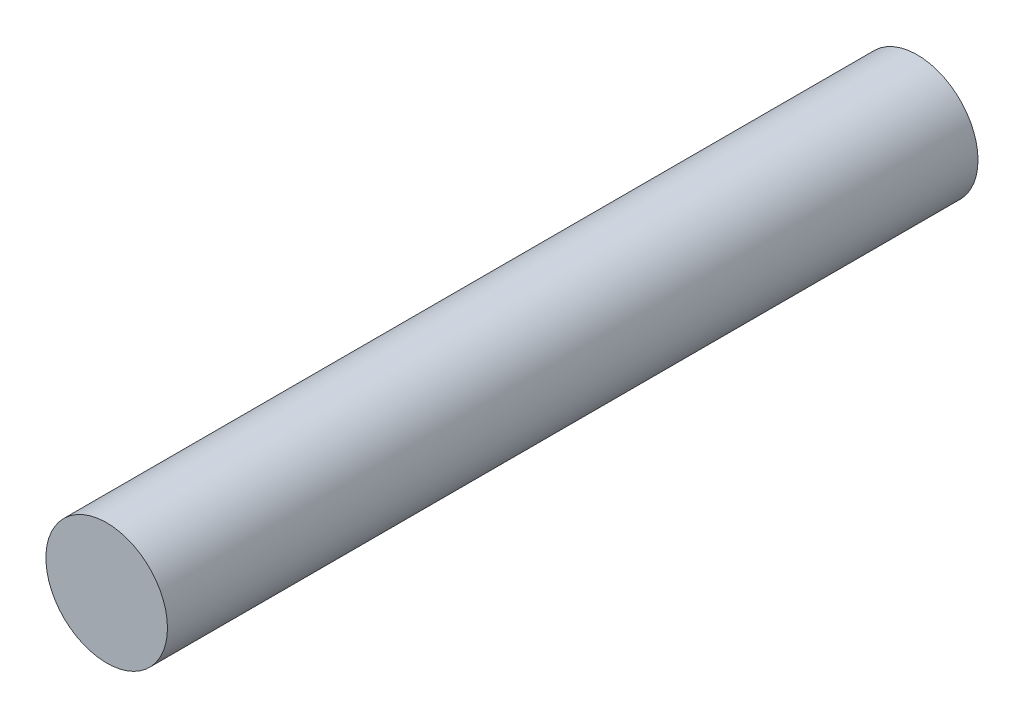
ISO-10303-21;
HEADER;
FILE_DESCRIPTION(('STEP AP214'),'2;1');
FILE_NAME('part.step','',(''),(''),'','','');
FILE_SCHEMA(('AUTOMOTIVE_DESIGN { 1 0 10303 214 1 1 1 1 }'));
ENDSEC;
DATA;
#1=APPLICATION_CONTEXT('core data for automotive mechanical design processes');
#2=APPLICATION_PROTOCOL_DEFINITION('international standard','automotive_design',2000,#1);
#3=PRODUCT_CONTEXT('',#1,'mechanical');
#4=PRODUCT('Part','Part','',(#3));
#5=PRODUCT_RELATED_PRODUCT_CATEGORY('part','',(#4));
#6=PRODUCT_DEFINITION_FORMATION('','',#4);
#7=PRODUCT_DEFINITION_CONTEXT('part definition',#1,'design');
#8=PRODUCT_DEFINITION('design','',#6,#7);
#9=PRODUCT_DEFINITION_SHAPE('','',#8);
#10=(LENGTH_UNIT() NAMED_UNIT(*) SI_UNIT(.MILLI.,.METRE.));
#11=(NAMED_UNIT(*) PLANE_ANGLE_UNIT() SI_UNIT($,.RADIAN.));
#12=(NAMED_UNIT(*) SI_UNIT($,.STERADIAN.) SOLID_ANGLE_UNIT());
#13=UNCERTAINTY_MEASURE_WITH_UNIT(LENGTH_MEASURE(1.E-05),#10,'distance_accuracy_value','');
#14=(GEOMETRIC_REPRESENTATION_CONTEXT(3) GLOBAL_UNCERTAINTY_ASSIGNED_CONTEXT((#13)) GLOBAL_UNIT_ASSIGNED_CONTEXT((#10,
#11,#12)) REPRESENTATION_CONTEXT('',''));
#15=CARTESIAN_POINT('',(0.,0.,0.));
#16=DIRECTION('',(0.,0.,1.));
#17=DIRECTION('',(1.,0.,0.));
#18=AXIS2_PLACEMENT_3D('',#15,#16,#17);
#19=CARTESIAN_POINT('',(0.,0.,200.));
#20=DIRECTION('',(0.,0.,-1.));
#21=DIRECTION('',(-1.,0.,0.));
#22=AXIS2_PLACEMENT_3D('',#19,#20,#21);
#23=CYLINDRICAL_SURFACE('',#22,15.);
#24=CARTESIAN_POINT('',(0.,0.,200.));
#25=DIRECTION('',(0.,0.,1.));
#26=DIRECTION('',(1.,0.,0.));
#27=AXIS2_PLACEMENT_3D('',#24,#25,#26);
#28=CIRCLE('',#27,15.);
#29=CARTESIAN_POINT('',(15.,0.,200.));
#30=VERTEX_POINT('',#29);
#31=EDGE_CURVE('E11',#30,#30,#28,.T.);
#32=ORIENTED_EDGE('',*,*,#31,.F.);
#33=EDGE_LOOP('',(#32));
#34=FACE_BOUND('',#33,.T.);
#35=CARTESIAN_POINT('',(0.,0.,0.));
#36=DIRECTION('',(0.,0.,1.));
#37=DIRECTION('',(1.,0.,0.));
#38=AXIS2_PLACEMENT_3D('',#35,#36,#37);
#39=CIRCLE('',#38,15.);
#40=CARTESIAN_POINT('',(15.,0.,0.));
#41=VERTEX_POINT('',#40);
#42=EDGE_CURVE('E37',#41,#41,#39,.T.);
#43=ORIENTED_EDGE('',*,*,#42,.T.);
#44=EDGE_LOOP('',(#43));
#45=FACE_BOUND('',#44,.T.);
#46=ADVANCED_FACE('F34',(#34,#45),#23,.T.);
#47=CARTESIAN_POINT('',(0.,0.,200.));
#48=DIRECTION('',(0.,0.,1.));
#49=DIRECTION('',(1.,0.,0.));
#50=AXIS2_PLACEMENT_3D('',#47,#48,#49);
#51=PLANE('',#50);
#52=ORIENTED_EDGE('',*,*,#31,.T.);
#53=EDGE_LOOP('',(#52));
#54=FACE_BOUND('',#53,.T.);
#55=ADVANCED_FACE('F126',(#54),#51,.T.);
#56=CARTESIAN_POINT('',(0.,0.,0.));
#57=DIRECTION('',(0.,0.,1.));
#58=DIRECTION('',(1.,0.,0.));
#59=AXIS2_PLACEMENT_3D('',#56,#57,#58);
#60=PLANE('',#59);
#61=DIRECTION('',(-1.,0.,0.));
#62=VECTOR('',#61,1.);
#63=CARTESIAN_POINT('',(13.,-5.,0.));
#64=LINE('',#63,#62);
#65=CARTESIAN_POINT('',(13.,-5.,0.));
#66=VERTEX_POINT('',#65);
#67=CARTESIAN_POINT('',(-12.,-5.,0.));
#68=VERTEX_POINT('',#67);
#69=EDGE_CURVE('E83',#66,#68,#64,.T.);
#70=ORIENTED_EDGE('',*,*,#69,.F.);
#71=DIRECTION('',(0.,-1.,0.));
#72=VECTOR('',#71,1.);
#73=CARTESIAN_POINT('',(13.,5.,0.));
#74=LINE('',#73,#72);
#75=CARTESIAN_POINT('',(13.,5.,0.));
#76=VERTEX_POINT('',#75);
#77=EDGE_CURVE('E48',#76,#66,#74,.T.);
#78=ORIENTED_EDGE('',*,*,#77,.F.);
#79=DIRECTION('',(1.,0.,0.));
#80=VECTOR('',#79,1.);
#81=CARTESIAN_POINT('',(13.,5.,0.));
#82=LINE('',#81,#80);
#83=CARTESIAN_POINT('',(-12.,5.,0.));
#84=VERTEX_POINT('',#83);
#85=EDGE_CURVE('E99',#84,#76,#82,.T.);
#86=ORIENTED_EDGE('',*,*,#85,.F.);
#87=DIRECTION('',(0.,1.,0.));
#88=VECTOR('',#87,1.);
#89=CARTESIAN_POINT('',(-12.,5.,0.));
#90=LINE('',#89,#88);
#91=EDGE_CURVE('E105',#68,#84,#90,.T.);
#92=ORIENTED_EDGE('',*,*,#91,.F.);
#93=EDGE_LOOP('',(#70,#78,#86,#92));
#94=FACE_BOUND('',#93,.T.);
#95=ORIENTED_EDGE('',*,*,#42,.F.);
#96=EDGE_LOOP('',(#95));
#97=FACE_BOUND('',#96,.T.);
#98=ADVANCED_FACE('F111',(#94,#97),#60,.F.);
#99=CARTESIAN_POINT('',(13.,5.,2.));
#100=DIRECTION('',(1.,0.,0.));
#101=DIRECTION('',(0.,1.,0.));
#102=AXIS2_PLACEMENT_3D('',#99,#100,#101);
#103=PLANE('',#102);
#104=ORIENTED_EDGE('',*,*,#77,.T.);
#105=DIRECTION('',(0.,0.,-1.));
#106=VECTOR('',#105,1.);
#107=CARTESIAN_POINT('',(13.,-5.,2.));
#108=LINE('',#107,#106);
#109=CARTESIAN_POINT('',(13.,-5.,2.));
#110=VERTEX_POINT('',#109);
#111=EDGE_CURVE('E71',#110,#66,#108,.T.);
#112=ORIENTED_EDGE('',*,*,#111,.F.);
#113=DIRECTION('',(0.,-1.,0.));
#114=VECTOR('',#113,1.);
#115=CARTESIAN_POINT('',(13.,5.,2.));
#116=LINE('',#115,#114);
#117=CARTESIAN_POINT('',(13.,5.,2.));
#118=VERTEX_POINT('',#117);
#119=EDGE_CURVE('E97',#118,#110,#116,.T.);
#120=ORIENTED_EDGE('',*,*,#119,.F.);
#121=DIRECTION('',(0.,0.,-1.));
#122=VECTOR('',#121,1.);
#123=CARTESIAN_POINT('',(13.,5.,2.));
#124=LINE('',#123,#122);
#125=EDGE_CURVE('E56',#118,#76,#124,.T.);
#126=ORIENTED_EDGE('',*,*,#125,.T.);
#127=EDGE_LOOP('',(#104,#112,#120,#126));
#128=FACE_BOUND('',#127,.T.);
#129=ADVANCED_FACE('F116',(#128),#103,.F.);
#130=CARTESIAN_POINT('',(13.,5.,2.));
#131=DIRECTION('',(0.,1.,0.));
#132=DIRECTION('',(0.,0.,1.));
#133=AXIS2_PLACEMENT_3D('',#130,#131,#132);
#134=PLANE('',#133);
#135=ORIENTED_EDGE('',*,*,#85,.T.);
#136=ORIENTED_EDGE('',*,*,#125,.F.);
#137=DIRECTION('',(1.,0.,0.));
#138=VECTOR('',#137,1.);
#139=CARTESIAN_POINT('',(13.,5.,2.));
#140=LINE('',#139,#138);
#141=CARTESIAN_POINT('',(-12.,5.,2.));
#142=VERTEX_POINT('',#141);
#143=EDGE_CURVE('E94',#142,#118,#140,.T.);
#144=ORIENTED_EDGE('',*,*,#143,.F.);
#145=DIRECTION('',(0.,0.,-1.));
#146=VECTOR('',#145,1.);
#147=CARTESIAN_POINT('',(-12.,5.,2.));
#148=LINE('',#147,#146);
#149=EDGE_CURVE('E87',#142,#84,#148,.T.);
#150=ORIENTED_EDGE('',*,*,#149,.T.);
#151=EDGE_LOOP('',(#135,#136,#144,#150));
#152=FACE_BOUND('',#151,.T.);
#153=ADVANCED_FACE('F114',(#152),#134,.F.);
#154=CARTESIAN_POINT('',(-12.,5.,2.));
#155=DIRECTION('',(-1.,0.,0.));
#156=DIRECTION('',(0.,0.,1.));
#157=AXIS2_PLACEMENT_3D('',#154,#155,#156);
#158=PLANE('',#157);
#159=ORIENTED_EDGE('',*,*,#91,.T.);
#160=ORIENTED_EDGE('',*,*,#149,.F.);
#161=DIRECTION('',(0.,1.,0.));
#162=VECTOR('',#161,1.);
#163=CARTESIAN_POINT('',(-12.,5.,2.));
#164=LINE('',#163,#162);
#165=CARTESIAN_POINT('',(-12.,-5.,2.));
#166=VERTEX_POINT('',#165);
#167=EDGE_CURVE('E90',#166,#142,#164,.T.);
#168=ORIENTED_EDGE('',*,*,#167,.F.);
#169=DIRECTION('',(0.,0.,-1.));
#170=VECTOR('',#169,1.);
#171=CARTESIAN_POINT('',(-12.,-5.,2.));
#172=LINE('',#171,#170);
#173=EDGE_CURVE('E76',#166,#68,#172,.T.);
#174=ORIENTED_EDGE('',*,*,#173,.T.);
#175=EDGE_LOOP('',(#159,#160,#168,#174));
#176=FACE_BOUND('',#175,.T.);
#177=ADVANCED_FACE('F91',(#176),#158,.F.);
#178=CARTESIAN_POINT('',(13.,-5.,2.));
#179=DIRECTION('',(0.,-1.,0.));
#180=DIRECTION('',(0.,0.,-1.));
#181=AXIS2_PLACEMENT_3D('',#178,#179,#180);
#182=PLANE('',#181);
#183=ORIENTED_EDGE('',*,*,#69,.T.);
#184=ORIENTED_EDGE('',*,*,#173,.F.);
#185=DIRECTION('',(-1.,0.,0.));
#186=VECTOR('',#185,1.);
#187=CARTESIAN_POINT('',(13.,-5.,2.));
#188=LINE('',#187,#186);
#189=EDGE_CURVE('E80',#110,#166,#188,.T.);
#190=ORIENTED_EDGE('',*,*,#189,.F.);
#191=ORIENTED_EDGE('',*,*,#111,.T.);
#192=EDGE_LOOP('',(#183,#184,#190,#191));
#193=FACE_BOUND('',#192,.T.);
#194=ADVANCED_FACE('F78',(#193),#182,.F.);
#195=CARTESIAN_POINT('',(0.,0.,2.));
#196=DIRECTION('',(0.,0.,-1.));
#197=DIRECTION('',(-1.,0.,0.));
#198=AXIS2_PLACEMENT_3D('',#195,#196,#197);
#199=PLANE('',#198);
#200=ORIENTED_EDGE('',*,*,#119,.T.);
#201=ORIENTED_EDGE('',*,*,#189,.T.);
#202=ORIENTED_EDGE('',*,*,#167,.T.);
#203=ORIENTED_EDGE('',*,*,#143,.T.);
#204=EDGE_LOOP('',(#200,#201,#202,#203));
#205=FACE_BOUND('',#204,.T.);
#206=ADVANCED_FACE('F96',(#205),#199,.T.);
#207=CLOSED_SHELL('',(#46,#55,#98,#129,#153,#177,#194,#206));
#208=MANIFOLD_SOLID_BREP('B2',#207);
#209=ADVANCED_BREP_SHAPE_REPRESENTATION('',(#18,#208),#14);
#210=SHAPE_DEFINITION_REPRESENTATION(#9,#209);
ENDSEC;
END-ISO-10303-21;
